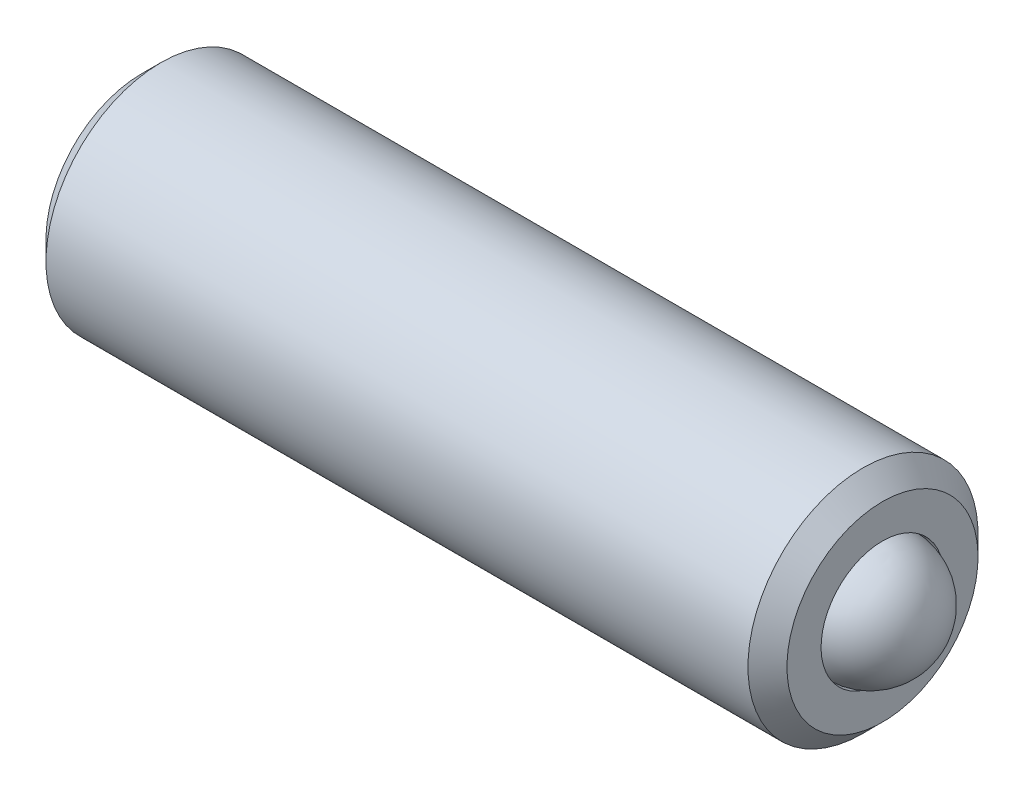
ISO-10303-21;
HEADER;
FILE_DESCRIPTION(('STEP AP214'),'2;1');
FILE_NAME('part.step','',(''),(''),'','','');
FILE_SCHEMA(('AUTOMOTIVE_DESIGN { 1 0 10303 214 1 1 1 1 }'));
ENDSEC;
DATA;
#1=APPLICATION_CONTEXT('core data for automotive mechanical design processes');
#2=APPLICATION_PROTOCOL_DEFINITION('international standard','automotive_design',2000,#1);
#3=PRODUCT_CONTEXT('',#1,'mechanical');
#4=PRODUCT('Part','Part','',(#3));
#5=PRODUCT_RELATED_PRODUCT_CATEGORY('part','',(#4));
#6=PRODUCT_DEFINITION_FORMATION('','',#4);
#7=PRODUCT_DEFINITION_CONTEXT('part definition',#1,'design');
#8=PRODUCT_DEFINITION('design','',#6,#7);
#9=PRODUCT_DEFINITION_SHAPE('','',#8);
#10=(LENGTH_UNIT() NAMED_UNIT(*) SI_UNIT(.MILLI.,.METRE.));
#11=(NAMED_UNIT(*) PLANE_ANGLE_UNIT() SI_UNIT($,.RADIAN.));
#12=(NAMED_UNIT(*) SI_UNIT($,.STERADIAN.) SOLID_ANGLE_UNIT());
#13=UNCERTAINTY_MEASURE_WITH_UNIT(LENGTH_MEASURE(1.E-05),#10,'distance_accuracy_value','');
#14=(GEOMETRIC_REPRESENTATION_CONTEXT(3) GLOBAL_UNCERTAINTY_ASSIGNED_CONTEXT((#13)) GLOBAL_UNIT_ASSIGNED_CONTEXT((#10,
#11,#12)) REPRESENTATION_CONTEXT('',''));
#15=CARTESIAN_POINT('',(0.,0.,0.));
#16=DIRECTION('',(0.,0.,1.));
#17=DIRECTION('',(1.,0.,0.));
#18=AXIS2_PLACEMENT_3D('',#15,#16,#17);
#19=CARTESIAN_POINT('',(-16.1649368515621,5.30011704688605,6.58733980014858));
#20=DIRECTION('',(1.,0.,0.));
#21=DIRECTION('',(0.,1.,0.));
#22=AXIS2_PLACEMENT_3D('',#19,#20,#21);
#23=CONICAL_SURFACE('',#22,0.,0.785398163397463);
#24=CARTESIAN_POINT('',(-15.38589211472,5.30011704688604,6.58733980014858));
#25=DIRECTION('',(1.,0.,0.));
#26=DIRECTION('',(0.,1.,0.));
#27=AXIS2_PLACEMENT_3D('',#24,#25,#26);
#28=CIRCLE('',#27,0.779044736842119);
#29=CARTESIAN_POINT('',(-15.38589211472,6.07916178372816,6.58733980014858));
#30=VERTEX_POINT('',#29);
#31=EDGE_CURVE('P0_E29',#30,#30,#28,.T.);
#32=ORIENTED_EDGE('',*,*,#31,.T.);
#33=EDGE_LOOP('',(#32));
#34=FACE_BOUND('',#33,.T.);
#35=CARTESIAN_POINT('',(-16.1649368515621,5.30011704688604,6.58733980014858));
#36=VERTEX_POINT('',#35);
#37=VERTEX_LOOP('',#36);
#38=FACE_BOUND('',#37,.T.);
#39=ADVANCED_FACE('P0_F17',(#34,#38),#23,.F.);
#40=CARTESIAN_POINT('',(-13.5053971619264,5.30011704688604,6.58733980014858));
#41=DIRECTION('',(1.,0.,0.));
#42=DIRECTION('',(0.,1.,0.));
#43=AXIS2_PLACEMENT_3D('',#40,#41,#42);
#44=CYLINDRICAL_SURFACE('',#43,0.779044736842126);
#45=CARTESIAN_POINT('',(-14.9173727841951,5.30011704688604,6.58733980014858));
#46=DIRECTION('',(1.,0.,0.));
#47=DIRECTION('',(0.,1.,0.));
#48=AXIS2_PLACEMENT_3D('',#45,#46,#47);
#49=CIRCLE('',#48,0.779044736842134);
#50=CARTESIAN_POINT('',(-14.9173727841951,6.07916178372818,6.58733980014858));
#51=VERTEX_POINT('',#50);
#52=EDGE_CURVE('P0_E114',#51,#51,#49,.T.);
#53=ORIENTED_EDGE('',*,*,#52,.T.);
#54=EDGE_LOOP('',(#53));
#55=FACE_BOUND('',#54,.T.);
#56=ORIENTED_EDGE('',*,*,#31,.F.);
#57=EDGE_LOOP('',(#56));
#58=FACE_BOUND('',#57,.T.);
#59=ADVANCED_FACE('P0_F120',(#55,#58),#44,.F.);
#60=CARTESIAN_POINT('',(-14.9173727841951,-2.95609471947092,6.58733980014858));
#61=DIRECTION('',(1.,0.,0.));
#62=DIRECTION('',(0.,1.,0.));
#63=AXIS2_PLACEMENT_3D('',#60,#61,#62);
#64=PLANE('',#63);
#65=CARTESIAN_POINT('',(-14.9173727841951,5.30011704688604,6.58733980014858));
#66=DIRECTION('',(1.,0.,0.));
#67=DIRECTION('',(0.,1.,0.));
#68=AXIS2_PLACEMENT_3D('',#65,#66,#67);
#69=CIRCLE('',#68,1.21184736842107);
#70=CARTESIAN_POINT('',(-14.9173727841951,6.51196441530712,6.58733980014858));
#71=VERTEX_POINT('',#70);
#72=EDGE_CURVE('P0_E111',#71,#71,#69,.T.);
#73=ORIENTED_EDGE('',*,*,#72,.T.);
#74=EDGE_LOOP('',(#73));
#75=FACE_BOUND('',#74,.T.);
#76=ORIENTED_EDGE('',*,*,#52,.F.);
#77=EDGE_LOOP('',(#76));
#78=FACE_BOUND('',#77,.T.);
#79=ADVANCED_FACE('P0_F122',(#75,#78),#64,.T.);
#80=CARTESIAN_POINT('',(-14.9173727841951,5.30011704688604,6.58733980014858));
#81=DIRECTION('',(-1.,0.,0.));
#82=DIRECTION('',(0.,-1.,0.));
#83=AXIS2_PLACEMENT_3D('',#80,#81,#82);
#84=CONICAL_SURFACE('',#83,1.21184736842107,0.78539816339756);
#85=CARTESIAN_POINT('',(-15.1646885736687,5.30011704688604,6.58733980014858));
#86=DIRECTION('',(1.,0.,0.));
#87=DIRECTION('',(0.,1.,0.));
#88=AXIS2_PLACEMENT_3D('',#85,#86,#87);
#89=CIRCLE('',#88,1.45916315789475);
#90=CARTESIAN_POINT('',(-15.1646885736687,6.75928020478079,6.58733980014858));
#91=VERTEX_POINT('',#90);
#92=EDGE_CURVE('P0_E108',#91,#91,#89,.T.);
#93=ORIENTED_EDGE('',*,*,#92,.T.);
#94=EDGE_LOOP('',(#93));
#95=FACE_BOUND('',#94,.T.);
#96=ORIENTED_EDGE('',*,*,#72,.F.);
#97=EDGE_LOOP('',(#96));
#98=FACE_BOUND('',#97,.T.);
#99=ADVANCED_FACE('P0_F129',(#95,#98),#84,.T.);
#100=CARTESIAN_POINT('',(-13.5053971619264,5.30011704688604,6.58733980014858));
#101=DIRECTION('',(1.,0.,0.));
#102=DIRECTION('',(0.,1.,0.));
#103=AXIS2_PLACEMENT_3D('',#100,#101,#102);
#104=CYLINDRICAL_SURFACE('',#103,1.45916315789474);
#105=CARTESIAN_POINT('',(-24.0680569947214,5.30011704688606,6.58733980014858));
#106=DIRECTION('',(1.,0.,0.));
#107=DIRECTION('',(0.,1.,0.));
#108=AXIS2_PLACEMENT_3D('',#105,#106,#107);
#109=CIRCLE('',#108,1.45916315789474);
#110=CARTESIAN_POINT('',(-24.0680569947214,6.75928020478079,6.58733980014858));
#111=VERTEX_POINT('',#110);
#112=EDGE_CURVE('P0_E105',#111,#111,#109,.T.);
#113=ORIENTED_EDGE('',*,*,#112,.T.);
#114=EDGE_LOOP('',(#113));
#115=FACE_BOUND('',#114,.T.);
#116=ORIENTED_EDGE('',*,*,#92,.F.);
#117=EDGE_LOOP('',(#116));
#118=FACE_BOUND('',#117,.T.);
#119=ADVANCED_FACE('P0_F135',(#115,#118),#104,.T.);
#120=CARTESIAN_POINT('',(-24.3153727841951,5.30011704688606,6.58733980014858));
#121=DIRECTION('',(1.,0.,0.));
#122=DIRECTION('',(0.,1.,0.));
#123=AXIS2_PLACEMENT_3D('',#120,#121,#122);
#124=CONICAL_SURFACE('',#123,1.21184736842106,0.785398163397448);
#125=ORIENTED_EDGE('',*,*,#112,.F.);
#126=EDGE_LOOP('',(#125));
#127=FACE_BOUND('',#126,.T.);
#128=CARTESIAN_POINT('',(-24.3153727841951,5.30011704688606,6.58733980014858));
#129=DIRECTION('',(1.,0.,0.));
#130=DIRECTION('',(0.,1.,0.));
#131=AXIS2_PLACEMENT_3D('',#128,#129,#130);
#132=CIRCLE('',#131,1.21184736842106);
#133=CARTESIAN_POINT('',(-24.3153727841951,6.51196441530712,6.58733980014858));
#134=VERTEX_POINT('',#133);
#135=EDGE_CURVE('P0_E102',#134,#134,#132,.T.);
#136=ORIENTED_EDGE('',*,*,#135,.T.);
#137=EDGE_LOOP('',(#136));
#138=FACE_BOUND('',#137,.T.);
#139=ADVANCED_FACE('P0_F139',(#127,#138),#124,.T.);
#140=CARTESIAN_POINT('',(-24.3153727841951,-2.95609471947092,6.58733980014858));
#141=DIRECTION('',(1.,0.,0.));
#142=DIRECTION('',(0.,1.,0.));
#143=AXIS2_PLACEMENT_3D('',#140,#141,#142);
#144=PLANE('',#143);
#145=CARTESIAN_POINT('',(-24.3153727841951,5.30011704688606,6.58733980014858));
#146=DIRECTION('',(-1.,0.,0.));
#147=DIRECTION('',(0.,0.,1.));
#148=AXIS2_PLACEMENT_3D('',#145,#146,#147);
#149=CIRCLE('',#148,0.952499999999998);
#150=CARTESIAN_POINT('',(-24.3153727841951,5.30011704688606,7.53983980014858));
#151=VERTEX_POINT('',#150);
#152=EDGE_CURVE('P0_E209',#151,#151,#149,.T.);
#153=ORIENTED_EDGE('',*,*,#152,.F.);
#154=EDGE_LOOP('',(#153));
#155=FACE_BOUND('',#154,.T.);
#156=ORIENTED_EDGE('',*,*,#135,.F.);
#157=EDGE_LOOP('',(#156));
#158=FACE_BOUND('',#157,.T.);
#159=ADVANCED_FACE('P0_F143',(#155,#158),#144,.F.);
#160=CARTESIAN_POINT('',(-24.3153727841951,5.30011704688606,6.58733980014858));
#161=DIRECTION('',(-1.,0.,0.));
#162=DIRECTION('',(0.,0.,1.));
#163=AXIS2_PLACEMENT_3D('',#160,#161,#162);
#164=CONICAL_SURFACE('',#163,0.952499999999998,0.78539816339745);
#165=ORIENTED_EDGE('',*,*,#152,.T.);
#166=EDGE_LOOP('',(#165));
#167=FACE_BOUND('',#166,.T.);
#168=CARTESIAN_POINT('',(-24.1122882809364,6.04953251693989,6.58753980014858));
#169=CARTESIAN_POINT('',(-24.0994116978392,6.03664807538529,6.56522329274888));
#170=CARTESIAN_POINT('',(-24.0872897779733,6.02354900538406,6.54253503797484));
#171=CARTESIAN_POINT('',(-24.0650940134772,5.99683824277898,6.49627064003392));
#172=CARTESIAN_POINT('',(-24.0550325308782,5.98322400520731,6.47269008885348));
#173=CARTESIAN_POINT('',(-24.0377989612112,5.95576974783476,6.42513792020014));
#174=CARTESIAN_POINT('',(-24.0305834771077,5.94193675960468,6.40117848176514));
#175=CARTESIAN_POINT('',(-24.0194573373189,5.91397282955961,6.35274353414777));
#176=CARTESIAN_POINT('',(-24.0155383947065,5.89984272694796,6.32826947850825));
#177=CARTESIAN_POINT('',(-24.0105664496441,5.86532882464225,6.26848964614727));
#178=CARTESIAN_POINT('',(-24.0114659858321,5.84486440834466,6.23304423737261));
#179=CARTESIAN_POINT('',(-24.0207345272524,5.8043645333307,6.16289639614824));
#180=CARTESIAN_POINT('',(-24.0291146864786,5.78432976093208,6.12819515243576));
#181=CARTESIAN_POINT('',(-24.0493237628653,5.74914470614097,6.06725284987045));
#182=CARTESIAN_POINT('',(-24.0600984857901,5.73383266567494,6.04073161781574));
#183=CARTESIAN_POINT('',(-24.084371399757,5.70380854875355,5.9887283218555));
#184=CARTESIAN_POINT('',(-24.0978607317419,5.68909470316656,5.96324319372411));
#185=CARTESIAN_POINT('',(-24.1122882809364,5.67465157683223,5.93822696509291));
#186=B_SPLINE_CURVE_WITH_KNOTS('',3,(#168,#169,#170,#171,#172,#173,#174,#175,#176,#177,#178,
#179,#180,#181,#182,#183,#184,#185),.UNSPECIFIED.,.F.,.F.,(4,2,2,2,2,2,2,2,4),(0.,
0.0864788641253323,0.173462284806156,0.259062693136939,0.344447268473216,0.466486555643632,
0.588708114182809,0.685962692863702,0.782904885826111),.UNSPECIFIED.);
#187=CARTESIAN_POINT('',(-24.112172784195,6.04941704688605,6.58733980014858));
#188=VERTEX_POINT('',#187);
#189=CARTESIAN_POINT('',(-24.1121727841951,5.67476704688607,5.93842696509291));
#190=VERTEX_POINT('',#189);
#191=EDGE_CURVE('P0_E86',#188,#190,#186,.T.);
#192=ORIENTED_EDGE('',*,*,#191,.F.);
#193=CARTESIAN_POINT('',(-24.1122882809364,6.04953251693989,6.58713980014858));
#194=CARTESIAN_POINT('',(-24.0994116978392,6.03664807538529,6.60945630754829));
#195=CARTESIAN_POINT('',(-24.0872897779733,6.02354900538406,6.63214456232233));
#196=CARTESIAN_POINT('',(-24.0650940134772,5.99683824277898,6.67840896026325));
#197=CARTESIAN_POINT('',(-24.0550325308782,5.98322400520731,6.70198951144369));
#198=CARTESIAN_POINT('',(-24.0377989612112,5.95576974783476,6.74954168009703));
#199=CARTESIAN_POINT('',(-24.0305834771077,5.94193675960467,6.77350111853203));
#200=CARTESIAN_POINT('',(-24.0194573373189,5.9139728295596,6.8219360661494));
#201=CARTESIAN_POINT('',(-24.0155383947065,5.89984272694796,6.84641012178892));
#202=CARTESIAN_POINT('',(-24.0105664496441,5.86532882464224,6.9061899541499));
#203=CARTESIAN_POINT('',(-24.0114659858321,5.84486440834466,6.94163536292456));
#204=CARTESIAN_POINT('',(-24.0207345272524,5.8043645333307,7.01178320414893));
#205=CARTESIAN_POINT('',(-24.0291146864786,5.78432976093208,7.04648444786141));
#206=CARTESIAN_POINT('',(-24.0493237628653,5.74914470614097,7.10742675042671));
#207=CARTESIAN_POINT('',(-24.0600984857901,5.73383266567494,7.13394798248142));
#208=CARTESIAN_POINT('',(-24.084371399757,5.70380854875356,7.18595127844164));
#209=CARTESIAN_POINT('',(-24.0978607317419,5.68909470316658,7.21143640657302));
#210=CARTESIAN_POINT('',(-24.1122882809363,5.67465157683225,7.23645263520422));
#211=B_SPLINE_CURVE_WITH_KNOTS('',3,(#193,#194,#195,#196,#197,#198,#199,#200,#201,#202,#203,
#204,#205,#206,#207,#208,#209,#210),.UNSPECIFIED.,.F.,.F.,(4,2,2,2,2,2,2,2,4),(0.,
0.0864788641253323,0.173462284806159,0.259062693136944,0.344447268473221,0.466486555643635,
0.588708114182813,0.685962692863683,0.782904885826061),.UNSPECIFIED.);
#212=CARTESIAN_POINT('',(-24.112172784195,5.67476704688608,7.23625263520422));
#213=VERTEX_POINT('',#212);
#214=EDGE_CURVE('P0_E185',#188,#213,#211,.T.);
#215=ORIENTED_EDGE('',*,*,#214,.T.);
#216=CARTESIAN_POINT('',(-25.8244120031371,2.92565132616278,7.23625263520422));
#217=CARTESIAN_POINT('',(-25.7666695618242,2.98551641269675,7.23625263520422));
#218=CARTESIAN_POINT('',(-25.7090006280355,3.04545273357072,7.23625263520422));
#219=CARTESIAN_POINT('',(-25.5938588055101,3.16551947855696,7.23625263520422));
#220=CARTESIAN_POINT('',(-25.5363859274071,3.22564991286385,7.23625263520422));
#221=CARTESIAN_POINT('',(-25.4215321708245,3.3463174507382,7.23625263520422));
#222=CARTESIAN_POINT('',(-25.3641519910459,3.40685521991708,7.23625263520422));
#223=CARTESIAN_POINT('',(-25.2497266363196,3.52824214865914,7.23625263520422));
#224=CARTESIAN_POINT('',(-25.1926814476985,3.58909129532031,7.23625263520422));
#225=CARTESIAN_POINT('',(-25.0718964752472,3.71888044744135,7.23625263520422));
#226=CARTESIAN_POINT('',(-25.0082164228055,3.78787612169468,7.23625263520422));
#227=CARTESIAN_POINT('',(-24.8816690100156,3.92662936161796,7.23625263520422));
#228=CARTESIAN_POINT('',(-24.8188017624351,3.99638703058094,7.23625263520422));
#229=CARTESIAN_POINT('',(-24.6944403562404,4.13690856649369,7.23625263520422));
#230=CARTESIAN_POINT('',(-24.6329440622191,4.20767053967862,7.23625263520422));
#231=CARTESIAN_POINT('',(-24.5120189975137,4.35093141716092,7.23625263520422));
#232=CARTESIAN_POINT('',(-24.4525896010283,4.42342978429843,7.23625263520422));
#233=CARTESIAN_POINT('',(-24.3602874901427,4.54214173762697,7.23625263520422));
#234=CARTESIAN_POINT('',(-24.3262076241513,4.58741065825985,7.23625263520422));
#235=CARTESIAN_POINT('',(-24.2601384844446,4.67960067182151,7.23625263520422));
#236=CARTESIAN_POINT('',(-24.2281531515495,4.72652463723265,7.23625263520422));
#237=CARTESIAN_POINT('',(-24.1683000582188,4.82161020118976,7.23625263520422));
#238=CARTESIAN_POINT('',(-24.1403607096645,4.86972600619985,7.23625263520422));
#239=CARTESIAN_POINT('',(-24.090223923701,4.96880657139468,7.23625263520422));
#240=CARTESIAN_POINT('',(-24.0680044507239,5.01975944965458,7.23625263520422));
#241=CARTESIAN_POINT('',(-24.0399111783945,5.104637382063,7.23625263520422));
#242=CARTESIAN_POINT('',(-24.0310386002454,5.13754233580447,7.23625263520422));
#243=CARTESIAN_POINT('',(-24.01802100153,5.20421821248286,7.23625263520422));
#244=CARTESIAN_POINT('',(-24.0138630572363,5.23798650738866,7.23625263520422));
#245=CARTESIAN_POINT('',(-24.0106072068775,5.31339599966162,7.23625263520422));
#246=CARTESIAN_POINT('',(-24.0128537982399,5.35510382954812,7.23625263520422));
#247=CARTESIAN_POINT('',(-24.0248996725293,5.43751908859895,7.23625263520422));
#248=CARTESIAN_POINT('',(-24.0347321029248,5.47822131595616,7.23625263520422));
#249=CARTESIAN_POINT('',(-24.0574265629764,5.54955312895261,7.23625263520422));
#250=CARTESIAN_POINT('',(-24.0692499643199,5.58053300521503,7.23625263520422));
#251=CARTESIAN_POINT('',(-24.0955304729871,5.6413681103386,7.23625263520422));
#252=CARTESIAN_POINT('',(-24.1099897488191,5.6712223885941,7.23625263520422));
#253=CARTESIAN_POINT('',(-24.1409658254327,5.73020716326388,7.23625263520422));
#254=CARTESIAN_POINT('',(-24.1575017322937,5.75932745378588,7.23625263520422));
#255=CARTESIAN_POINT('',(-24.1919797963746,5.81669708865489,7.23625263520422));
#256=CARTESIAN_POINT('',(-24.2099213315571,5.84494681063152,7.23625263520422));
#257=CARTESIAN_POINT('',(-24.2517750038145,5.90819908080202,7.23625263520422));
#258=CARTESIAN_POINT('',(-24.2760026362462,5.94299161349801,7.23625263520422));
#259=CARTESIAN_POINT('',(-24.3256380954784,6.01172806261161,7.23625263520422));
#260=CARTESIAN_POINT('',(-24.351046187909,6.04567178535863,7.23625263520422));
#261=CARTESIAN_POINT('',(-24.4285711854334,6.14658073260329,7.23625263520422));
#262=CARTESIAN_POINT('',(-24.4819523559903,6.2125710187918,7.23625263520422));
#263=CARTESIAN_POINT('',(-24.5907888315353,6.34317754125328,7.23625263520422));
#264=CARTESIAN_POINT('',(-24.6462506465088,6.40778826276307,7.23625263520422));
#265=CARTESIAN_POINT('',(-24.7583493076307,6.53592814415553,7.23625263520422));
#266=CARTESIAN_POINT('',(-24.8149856078379,6.59945778262245,7.23625263520422));
#267=CARTESIAN_POINT('',(-24.9227420017332,6.71880767153528,7.23625263520422));
#268=CARTESIAN_POINT('',(-24.9737791009372,6.77470319932327,7.23625263520422));
#269=CARTESIAN_POINT('',(-25.0763180333029,6.88608016928774,7.23625263520422));
#270=CARTESIAN_POINT('',(-25.1278199292051,6.9415615536571,7.23625263520422));
#271=CARTESIAN_POINT('',(-25.230819655692,7.0518373561343,7.23625263520422));
#272=CARTESIAN_POINT('',(-25.2823152264916,7.10663388833872,7.23625263520422));
#273=CARTESIAN_POINT('',(-25.3855603498971,7.21597008680882,7.23625263520422));
#274=CARTESIAN_POINT('',(-25.4373098589921,7.27050979414348,7.23625263520422));
#275=CARTESIAN_POINT('',(-25.4891540128114,7.32495876802532,7.23625263520422));
#276=B_SPLINE_CURVE_WITH_KNOTS('',3,(#216,#217,#218,#219,#220,#221,#222,#223,#224,#225,#226,
#227,#228,#229,#230,#231,#232,#233,#234,#235,#236,#237,#238,#239,#240,#241,#242,#243,#244,#245,
#246,#247,#248,#249,#250,#251,#252,#253,#254,#255,#256,#257,#258,#259,#260,#261,#262,#263,#264,
#265,#266,#267,#268,#269,#270,#271,#272,#273,#274,#275),.UNSPECIFIED.,.F.,.F.,(4,2,2,2,2,2,2,2,
2,2,2,2,2,2,2,2,2,2,2,2,2,2,2,2,2,2,2,2,2,4),(0.,0.249524169444031,0.499061664048938,
0.749292126030682,0.999512302282562,1.28118188446115,1.56289013456267,1.84412364646045,
2.12527125365822,2.29522422452411,2.46548827885794,2.63222422359169,2.79830787351794,
2.90027530295211,3.00196253895413,3.12646325295125,3.25151109444025,3.35084711072832,
3.45026522165717,3.55067620712127,3.65104300569425,3.77819720424601,3.90538015527491,
4.15993807573811,4.4153726679977,4.67069107504108,4.89776066228876,5.12486137303339,
5.35044877312649,5.57599878315938),.UNSPECIFIED.);
#277=CARTESIAN_POINT('',(-24.112172784195,4.92546704688603,7.23625263520422));
#278=VERTEX_POINT('',#277);
#279=EDGE_CURVE('P0_E180',#213,#278,#276,.F.);
#280=ORIENTED_EDGE('',*,*,#279,.T.);
#281=CARTESIAN_POINT('',(-24.1122882809363,4.92558251693987,7.23645263520422));
#282=CARTESIAN_POINT('',(-24.0994116978392,4.91269807538528,7.21413612780451));
#283=CARTESIAN_POINT('',(-24.0872897779733,4.89959900538405,7.19144787303048));
#284=CARTESIAN_POINT('',(-24.0650940134772,4.87288824277896,7.14518347508956));
#285=CARTESIAN_POINT('',(-24.0550325308782,4.8592740052073,7.12160292390912));
#286=CARTESIAN_POINT('',(-24.0377989612112,4.83181974783475,7.07405075525579));
#287=CARTESIAN_POINT('',(-24.0305834771077,4.81798675960467,7.05009131682079));
#288=CARTESIAN_POINT('',(-24.0194573373189,4.7900228295596,7.00165636920343));
#289=CARTESIAN_POINT('',(-24.0155383947065,4.77589272694796,6.9771823135639));
#290=CARTESIAN_POINT('',(-24.0105664496441,4.74137882464224,6.91740248120293));
#291=CARTESIAN_POINT('',(-24.0114659858321,4.72091440834466,6.88195707242827));
#292=CARTESIAN_POINT('',(-24.0207345272524,4.6804145333307,6.8118092312039));
#293=CARTESIAN_POINT('',(-24.0291146864786,4.66037976093208,6.77710798749142));
#294=CARTESIAN_POINT('',(-24.0493237628653,4.62519470614097,6.71616568492612));
#295=CARTESIAN_POINT('',(-24.0600984857901,4.60988266567494,6.68964445287141));
#296=CARTESIAN_POINT('',(-24.084371399757,4.57985854875355,6.63764115691117));
#297=CARTESIAN_POINT('',(-24.0978607317419,4.56514470316656,6.61215602877979));
#298=CARTESIAN_POINT('',(-24.1122882809364,4.55070157683223,6.58713980014858));
#299=B_SPLINE_CURVE_WITH_KNOTS('',3,(#281,#282,#283,#284,#285,#286,#287,#288,#289,#290,#291,
#292,#293,#294,#295,#296,#297,#298),.UNSPECIFIED.,.F.,.F.,(4,2,2,2,2,2,2,2,4),(0.,
0.0864788641253256,0.173462284806142,0.259062693136919,0.344447268473186,0.466486555643597,
0.588708114182773,0.685962692863662,0.782904885826062),.UNSPECIFIED.);
#300=CARTESIAN_POINT('',(-24.112172784195,4.55081704688607,6.58733980014858));
#301=VERTEX_POINT('',#300);
#302=EDGE_CURVE('P0_E36',#278,#301,#299,.T.);
#303=ORIENTED_EDGE('',*,*,#302,.T.);
#304=CARTESIAN_POINT('',(-24.1122882809364,4.92558251693989,5.93822696509291));
#305=CARTESIAN_POINT('',(-24.0994116978392,4.91269807538529,5.96054347249262));
#306=CARTESIAN_POINT('',(-24.0872897779733,4.89959900538406,5.98323172726665));
#307=CARTESIAN_POINT('',(-24.0650940134772,4.87288824277898,6.02949612520758));
#308=CARTESIAN_POINT('',(-24.0550325308782,4.85927400520731,6.05307667638802));
#309=CARTESIAN_POINT('',(-24.0377989612112,4.83181974783476,6.10062884504136));
#310=CARTESIAN_POINT('',(-24.0305834771077,4.81798675960467,6.12458828347636));
#311=CARTESIAN_POINT('',(-24.0194573373189,4.7900228295596,6.17302323109373));
#312=CARTESIAN_POINT('',(-24.0155383947065,4.77589272694796,6.19749728673326));
#313=CARTESIAN_POINT('',(-24.0105664496441,4.74137882464224,6.25727711909423));
#314=CARTESIAN_POINT('',(-24.0114659858321,4.72091440834466,6.29272252786889));
#315=CARTESIAN_POINT('',(-24.0207345272524,4.6804145333307,6.36287036909326));
#316=CARTESIAN_POINT('',(-24.0291146864786,4.66037976093208,6.39757161280575));
#317=CARTESIAN_POINT('',(-24.0493237628653,4.62519470614097,6.45851391537105));
#318=CARTESIAN_POINT('',(-24.0600984857901,4.60988266567494,6.48503514742576));
#319=CARTESIAN_POINT('',(-24.084371399757,4.57985854875355,6.53703844338599));
#320=CARTESIAN_POINT('',(-24.0978607317419,4.56514470316656,6.56252357151738));
#321=CARTESIAN_POINT('',(-24.1122882809364,4.55070157683223,6.58753980014858));
#322=B_SPLINE_CURVE_WITH_KNOTS('',3,(#304,#305,#306,#307,#308,#309,#310,#311,#312,#313,#314,
#315,#316,#317,#318,#319,#320,#321),.UNSPECIFIED.,.F.,.F.,(4,2,2,2,2,2,2,2,4),(0.,
0.0864788641253373,0.173462284806167,0.259062693136953,0.344447268473234,0.466486555643647,
0.588708114182824,0.685962692863711,0.782904885826113),.UNSPECIFIED.);
#323=CARTESIAN_POINT('',(-24.1121727841951,4.92546704688605,5.93842696509291));
#324=VERTEX_POINT('',#323);
#325=EDGE_CURVE('P0_E11',#324,#301,#322,.T.);
#326=ORIENTED_EDGE('',*,*,#325,.F.);
#327=CARTESIAN_POINT('',(-25.8244120031371,2.92565132616283,5.93842696509291));
#328=CARTESIAN_POINT('',(-25.7666695618242,2.98551641269679,5.93842696509291));
#329=CARTESIAN_POINT('',(-25.7090006280355,3.04545273357076,5.93842696509291));
#330=CARTESIAN_POINT('',(-25.5938588055101,3.16551947855698,5.93842696509291));
#331=CARTESIAN_POINT('',(-25.5363859274071,3.22564991286387,5.93842696509291));
#332=CARTESIAN_POINT('',(-25.4215321708245,3.3463174507382,5.93842696509291));
#333=CARTESIAN_POINT('',(-25.3641519910459,3.40685521991708,5.93842696509291));
#334=CARTESIAN_POINT('',(-25.2497266363196,3.52824214865913,5.93842696509291));
#335=CARTESIAN_POINT('',(-25.1926814476985,3.58909129532029,5.93842696509291));
#336=CARTESIAN_POINT('',(-25.0718964752473,3.71888044744132,5.93842696509291));
#337=CARTESIAN_POINT('',(-25.0082164228055,3.78787612169464,5.93842696509291));
#338=CARTESIAN_POINT('',(-24.8816690100157,3.9266293616179,5.93842696509291));
#339=CARTESIAN_POINT('',(-24.8188017624351,3.99638703058088,5.93842696509291));
#340=CARTESIAN_POINT('',(-24.6944403562404,4.13690856649361,5.93842696509291));
#341=CARTESIAN_POINT('',(-24.6329440622192,4.20767053967853,5.93842696509291));
#342=CARTESIAN_POINT('',(-24.5120189975139,4.35093141716082,5.93842696509291));
#343=CARTESIAN_POINT('',(-24.4525896010284,4.42342978429833,5.93842696509291));
#344=CARTESIAN_POINT('',(-24.3602874901428,4.54214173762686,5.93842696509291));
#345=CARTESIAN_POINT('',(-24.3262076241514,4.58741065825976,5.93842696509291));
#346=CARTESIAN_POINT('',(-24.2601384844447,4.67960067182144,5.93842696509291));
#347=CARTESIAN_POINT('',(-24.2281531515496,4.72652463723258,5.93842696509291));
#348=CARTESIAN_POINT('',(-24.1683000582189,4.82161020118972,5.93842696509291));
#349=CARTESIAN_POINT('',(-24.1403607096646,4.86972600619982,5.93842696509291));
#350=CARTESIAN_POINT('',(-24.090223923701,4.96880657139468,5.93842696509291));
#351=CARTESIAN_POINT('',(-24.0680044507239,5.01975944965459,5.93842696509291));
#352=CARTESIAN_POINT('',(-24.0399111783945,5.10463738206302,5.93842696509291));
#353=CARTESIAN_POINT('',(-24.0310386002454,5.13754233580449,5.93842696509291));
#354=CARTESIAN_POINT('',(-24.01802100153,5.20421821248289,5.93842696509291));
#355=CARTESIAN_POINT('',(-24.0138630572363,5.2379865073887,5.93842696509291));
#356=CARTESIAN_POINT('',(-24.0106072068775,5.31339599966166,5.93842696509291));
#357=CARTESIAN_POINT('',(-24.0128537982399,5.35510382954816,5.93842696509291));
#358=CARTESIAN_POINT('',(-24.0248996725293,5.43751908859898,5.93842696509291));
#359=CARTESIAN_POINT('',(-24.0347321029249,5.47822131595619,5.93842696509291));
#360=CARTESIAN_POINT('',(-24.0574265629765,5.54955312895264,5.93842696509291));
#361=CARTESIAN_POINT('',(-24.0692499643199,5.58053300521506,5.93842696509291));
#362=CARTESIAN_POINT('',(-24.0955304729871,5.64136811033865,5.93842696509291));
#363=CARTESIAN_POINT('',(-24.1099897488191,5.67122238859415,5.93842696509291));
#364=CARTESIAN_POINT('',(-24.1409658254327,5.73020716326394,5.93842696509291));
#365=CARTESIAN_POINT('',(-24.1575017322938,5.75932745378594,5.93842696509291));
#366=CARTESIAN_POINT('',(-24.1919797963747,5.81669708865496,5.93842696509291));
#367=CARTESIAN_POINT('',(-24.2099213315572,5.84494681063159,5.93842696509291));
#368=CARTESIAN_POINT('',(-24.2517750038146,5.9081990808021,5.93842696509291));
#369=CARTESIAN_POINT('',(-24.2760026362463,5.9429916134981,5.93842696509291));
#370=CARTESIAN_POINT('',(-24.3256380954785,6.01172806261171,5.93842696509291));
#371=CARTESIAN_POINT('',(-24.3510461879091,6.04567178535874,5.93842696509291));
#372=CARTESIAN_POINT('',(-24.4285711854335,6.14658073260341,5.93842696509291));
#373=CARTESIAN_POINT('',(-24.4819523559904,6.21257101879192,5.93842696509291));
#374=CARTESIAN_POINT('',(-24.5907888315354,6.34317754125342,5.93842696509291));
#375=CARTESIAN_POINT('',(-24.6462506465089,6.40778826276323,5.93842696509291));
#376=CARTESIAN_POINT('',(-24.7583493076308,6.5359281441557,5.93842696509291));
#377=CARTESIAN_POINT('',(-24.8149856078381,6.59945778262263,5.93842696509291));
#378=CARTESIAN_POINT('',(-24.9227420017334,6.71880767153548,5.93842696509291));
#379=CARTESIAN_POINT('',(-24.9737791009374,6.77470319932348,5.93842696509291));
#380=CARTESIAN_POINT('',(-25.0763180333032,6.88608016928796,5.93842696509291));
#381=CARTESIAN_POINT('',(-25.1278199292053,6.94156155365733,5.93842696509291));
#382=CARTESIAN_POINT('',(-25.2308196556923,7.05183735613454,5.93842696509291));
#383=CARTESIAN_POINT('',(-25.2823152264918,7.10663388833897,5.93842696509291));
#384=CARTESIAN_POINT('',(-25.3855603498974,7.21597008680908,5.93842696509291));
#385=CARTESIAN_POINT('',(-25.4373098589924,7.27050979414375,5.93842696509291));
#386=CARTESIAN_POINT('',(-25.4891540128117,7.3249587680256,5.93842696509291));
#387=B_SPLINE_CURVE_WITH_KNOTS('',3,(#327,#328,#329,#330,#331,#332,#333,#334,#335,#336,#337,
#338,#339,#340,#341,#342,#343,#344,#345,#346,#347,#348,#349,#350,#351,#352,#353,#354,#355,#356,
#357,#358,#359,#360,#361,#362,#363,#364,#365,#366,#367,#368,#369,#370,#371,#372,#373,#374,#375,
#376,#377,#378,#379,#380,#381,#382,#383,#384,#385,#386),.UNSPECIFIED.,.F.,.F.,(4,2,2,2,2,2,2,2,
2,2,2,2,2,2,2,2,2,2,2,2,2,2,2,2,2,2,2,2,2,4),(0.,0.249524169444003,0.499061664048886,
0.749292126030604,0.999512302282453,1.28118188446102,1.5628901345625,1.84412364646025,
2.12527125365799,2.29522422452393,2.4654882788578,2.63222422359159,2.79830787351787,
2.90027530295205,3.00196253895408,3.1264632529512,3.25151109444019,3.35084711072827,
3.45026522165714,3.55067620712125,3.65104300569425,3.77819720424603,3.90538015527495,
4.15993807573819,4.41537266799782,4.67069107504123,4.89776066228894,5.12486137303361,
5.35044877312675,5.57599878315966),.UNSPECIFIED.);
#388=EDGE_CURVE('P0_E72',#190,#324,#387,.F.);
#389=ORIENTED_EDGE('',*,*,#388,.F.);
#390=EDGE_LOOP('',(#192,#215,#280,#303,#326,#389));
#391=FACE_BOUND('',#390,.T.);
#392=ADVANCED_FACE('P0_F71',(#167,#391),#164,.F.);
#393=CARTESIAN_POINT('',(-22.7913727841951,2.49263148012241,6.58733980014858));
#394=DIRECTION('',(-1.,0.,0.));
#395=DIRECTION('',(0.,-1.,0.));
#396=AXIS2_PLACEMENT_3D('',#393,#394,#395);
#397=PLANE('',#396);
#398=DIRECTION('',(0.,-1.,0.));
#399=VECTOR('',#398,1.);
#400=CARTESIAN_POINT('',(-22.7913727841951,2.49263148012241,5.93842696509291));
#401=LINE('',#400,#399);
#402=CARTESIAN_POINT('',(-22.7913727841951,5.67476704688606,5.93842696509291));
#403=VERTEX_POINT('',#402);
#404=CARTESIAN_POINT('',(-22.7913727841951,4.92546704688605,5.93842696509291));
#405=VERTEX_POINT('',#404);
#406=EDGE_CURVE('P0_E85',#403,#405,#401,.T.);
#407=ORIENTED_EDGE('',*,*,#406,.T.);
#408=DIRECTION('',(0.,-0.499999999999986,0.866025403784447));
#409=VECTOR('',#408,1.);
#410=CARTESIAN_POINT('',(-22.7913727841951,4.03627065519518,7.47856029340847));
#411=LINE('',#410,#409);
#412=CARTESIAN_POINT('',(-22.7913727841951,4.55081704688607,6.58733980014858));
#413=VERTEX_POINT('',#412);
#414=EDGE_CURVE('P0_E90',#405,#413,#411,.T.);
#415=ORIENTED_EDGE('',*,*,#414,.T.);
#416=DIRECTION('',(0.,-0.499999999999993,-0.866025403784443));
#417=VECTOR('',#416,1.);
#418=CARTESIAN_POINT('',(-22.7913727841951,4.03627065519517,5.69611930688869));
#419=LINE('',#418,#417);
#420=CARTESIAN_POINT('',(-22.7913727841951,4.92546704688603,7.23625263520422));
#421=VERTEX_POINT('',#420);
#422=EDGE_CURVE('P0_E224',#421,#413,#419,.T.);
#423=ORIENTED_EDGE('',*,*,#422,.F.);
#424=DIRECTION('',(0.,-1.,0.));
#425=VECTOR('',#424,1.);
#426=CARTESIAN_POINT('',(-22.7913727841951,2.49263148012241,7.23625263520422));
#427=LINE('',#426,#425);
#428=CARTESIAN_POINT('',(-22.7913727841951,5.67476704688608,7.23625263520422));
#429=VERTEX_POINT('',#428);
#430=EDGE_CURVE('P0_E214',#429,#421,#427,.T.);
#431=ORIENTED_EDGE('',*,*,#430,.F.);
#432=DIRECTION('',(0.,-0.499999999999993,0.866025403784443));
#433=VECTOR('',#432,1.);
#434=CARTESIAN_POINT('',(-22.7913727841951,5.16022065519516,8.12747312846414));
#435=LINE('',#434,#433);
#436=CARTESIAN_POINT('',(-22.7913727841951,6.04941704688605,6.58733980014858));
#437=VERTEX_POINT('',#436);
#438=EDGE_CURVE('P0_E98',#437,#429,#435,.T.);
#439=ORIENTED_EDGE('',*,*,#438,.F.);
#440=DIRECTION('',(0.,-0.499999999999986,-0.866025403784447));
#441=VECTOR('',#440,1.);
#442=CARTESIAN_POINT('',(-22.7913727841951,5.16022065519519,5.04720647183304));
#443=LINE('',#442,#441);
#444=EDGE_CURVE('P0_E93',#437,#403,#443,.T.);
#445=ORIENTED_EDGE('',*,*,#444,.T.);
#446=EDGE_LOOP('',(#407,#415,#423,#431,#439,#445));
#447=FACE_BOUND('',#446,.T.);
#448=ADVANCED_FACE('P0_F167',(#447),#397,.T.);
#449=CARTESIAN_POINT('',(-22.7913727841951,4.03627065519518,7.47856029340847));
#450=DIRECTION('',(0.,-0.866025403784447,-0.499999999999986));
#451=DIRECTION('',(0.,0.499999999999986,-0.866025403784447));
#452=AXIS2_PLACEMENT_3D('',#449,#450,#451);
#453=PLANE('',#452);
#454=DIRECTION('',(-1.,0.,0.));
#455=VECTOR('',#454,1.);
#456=CARTESIAN_POINT('',(-22.7913727841951,4.92546704688605,5.93842696509291));
#457=LINE('',#456,#455);
#458=EDGE_CURVE('P0_E82',#405,#324,#457,.T.);
#459=ORIENTED_EDGE('',*,*,#458,.T.);
#460=ORIENTED_EDGE('',*,*,#325,.T.);
#461=DIRECTION('',(-1.,0.,0.));
#462=VECTOR('',#461,1.);
#463=CARTESIAN_POINT('',(-22.7913727841951,4.55081704688607,6.58733980014858));
#464=LINE('',#463,#462);
#465=EDGE_CURVE('P0_E92',#413,#301,#464,.T.);
#466=ORIENTED_EDGE('',*,*,#465,.F.);
#467=ORIENTED_EDGE('',*,*,#414,.F.);
#468=EDGE_LOOP('',(#459,#460,#466,#467));
#469=FACE_BOUND('',#468,.T.);
#470=ADVANCED_FACE('P0_F88',(#469),#453,.F.);
#471=CARTESIAN_POINT('',(-22.7913727841951,4.03627065519517,5.69611930688869));
#472=DIRECTION('',(0.,0.866025403784443,-0.499999999999993));
#473=DIRECTION('',(0.,0.499999999999993,0.866025403784443));
#474=AXIS2_PLACEMENT_3D('',#471,#472,#473);
#475=PLANE('',#474);
#476=ORIENTED_EDGE('',*,*,#302,.F.);
#477=DIRECTION('',(-1.,0.,0.));
#478=VECTOR('',#477,1.);
#479=CARTESIAN_POINT('',(-22.7913727841951,4.92546704688603,7.23625263520422));
#480=LINE('',#479,#478);
#481=EDGE_CURVE('P0_E95',#421,#278,#480,.T.);
#482=ORIENTED_EDGE('',*,*,#481,.F.);
#483=ORIENTED_EDGE('',*,*,#422,.T.);
#484=ORIENTED_EDGE('',*,*,#465,.T.);
#485=EDGE_LOOP('',(#476,#482,#483,#484));
#486=FACE_BOUND('',#485,.T.);
#487=ADVANCED_FACE('P0_F198',(#486),#475,.T.);
#488=CARTESIAN_POINT('',(-22.7913727841951,2.49263148012241,7.23625263520422));
#489=DIRECTION('',(0.,0.,-1.));
#490=DIRECTION('',(0.,1.,0.));
#491=AXIS2_PLACEMENT_3D('',#488,#489,#490);
#492=PLANE('',#491);
#493=ORIENTED_EDGE('',*,*,#279,.F.);
#494=DIRECTION('',(-1.,0.,0.));
#495=VECTOR('',#494,1.);
#496=CARTESIAN_POINT('',(-22.7913727841951,5.67476704688608,7.23625263520422));
#497=LINE('',#496,#495);
#498=EDGE_CURVE('P0_E215',#429,#213,#497,.T.);
#499=ORIENTED_EDGE('',*,*,#498,.F.);
#500=ORIENTED_EDGE('',*,*,#430,.T.);
#501=ORIENTED_EDGE('',*,*,#481,.T.);
#502=EDGE_LOOP('',(#493,#499,#500,#501));
#503=FACE_BOUND('',#502,.T.);
#504=ADVANCED_FACE('P0_F193',(#503),#492,.T.);
#505=CARTESIAN_POINT('',(-22.7913727841951,5.16022065519516,8.12747312846414));
#506=DIRECTION('',(0.,-0.866025403784443,-0.499999999999993));
#507=DIRECTION('',(0.,0.499999999999993,-0.866025403784443));
#508=AXIS2_PLACEMENT_3D('',#505,#506,#507);
#509=PLANE('',#508);
#510=ORIENTED_EDGE('',*,*,#214,.F.);
#511=DIRECTION('',(-1.,0.,0.));
#512=VECTOR('',#511,1.);
#513=CARTESIAN_POINT('',(-22.7913727841951,6.04941704688605,6.58733980014858));
#514=LINE('',#513,#512);
#515=EDGE_CURVE('P0_E216',#437,#188,#514,.T.);
#516=ORIENTED_EDGE('',*,*,#515,.F.);
#517=ORIENTED_EDGE('',*,*,#438,.T.);
#518=ORIENTED_EDGE('',*,*,#498,.T.);
#519=EDGE_LOOP('',(#510,#516,#517,#518));
#520=FACE_BOUND('',#519,.T.);
#521=ADVANCED_FACE('P0_F190',(#520),#509,.T.);
#522=CARTESIAN_POINT('',(-22.7913727841951,5.16022065519519,5.04720647183304));
#523=DIRECTION('',(0.,0.866025403784447,-0.499999999999986));
#524=DIRECTION('',(0.,0.499999999999986,0.866025403784447));
#525=AXIS2_PLACEMENT_3D('',#522,#523,#524);
#526=PLANE('',#525);
#527=ORIENTED_EDGE('',*,*,#515,.T.);
#528=ORIENTED_EDGE('',*,*,#191,.T.);
#529=DIRECTION('',(-1.,0.,0.));
#530=VECTOR('',#529,1.);
#531=CARTESIAN_POINT('',(-22.7913727841951,5.67476704688606,5.93842696509291));
#532=LINE('',#531,#530);
#533=EDGE_CURVE('P0_E84',#403,#190,#532,.T.);
#534=ORIENTED_EDGE('',*,*,#533,.F.);
#535=ORIENTED_EDGE('',*,*,#444,.F.);
#536=EDGE_LOOP('',(#527,#528,#534,#535));
#537=FACE_BOUND('',#536,.T.);
#538=ADVANCED_FACE('P0_F150',(#537),#526,.F.);
#539=CARTESIAN_POINT('',(-22.7913727841951,2.49263148012241,5.93842696509291));
#540=DIRECTION('',(0.,0.,-1.));
#541=DIRECTION('',(-1.,0.,0.));
#542=AXIS2_PLACEMENT_3D('',#539,#540,#541);
#543=PLANE('',#542);
#544=ORIENTED_EDGE('',*,*,#533,.T.);
#545=ORIENTED_EDGE('',*,*,#388,.T.);
#546=ORIENTED_EDGE('',*,*,#458,.F.);
#547=ORIENTED_EDGE('',*,*,#406,.F.);
#548=EDGE_LOOP('',(#544,#545,#546,#547));
#549=FACE_BOUND('',#548,.T.);
#550=ADVANCED_FACE('P0_F80',(#549),#543,.F.);
#551=CLOSED_SHELL('',(#39,#59,#79,#99,#119,#139,#159,#392,#448,#470,#487,#504,#521,#538,#550));
#552=MANIFOLD_SOLID_BREP('P0_B1',#551);
#553=CARTESIAN_POINT('',(-15.0719451526162,5.30011704688604,6.58733980014858));
#554=DIRECTION('',(1.,0.,0.));
#555=DIRECTION('',(0.,1.,0.));
#556=AXIS2_PLACEMENT_3D('',#553,#554,#555);
#557=SPHERICAL_SURFACE('',#556,0.772861842105288);
#558=CARTESIAN_POINT('',(-14.2990833105109,5.30011704688604,6.58733980014858));
#559=VERTEX_POINT('',#558);
#560=VERTEX_LOOP('',#559);
#561=FACE_BOUND('',#560,.T.);
#562=ADVANCED_FACE('P1_F12',(#561),#557,.T.);
#563=CLOSED_SHELL('',(#562));
#564=MANIFOLD_SOLID_BREP('P1_B1',#563);
#565=ADVANCED_BREP_SHAPE_REPRESENTATION('',(#18,#552,#564),#14);
#566=SHAPE_DEFINITION_REPRESENTATION(#9,#565);
ENDSEC;
END-ISO-10303-21;
